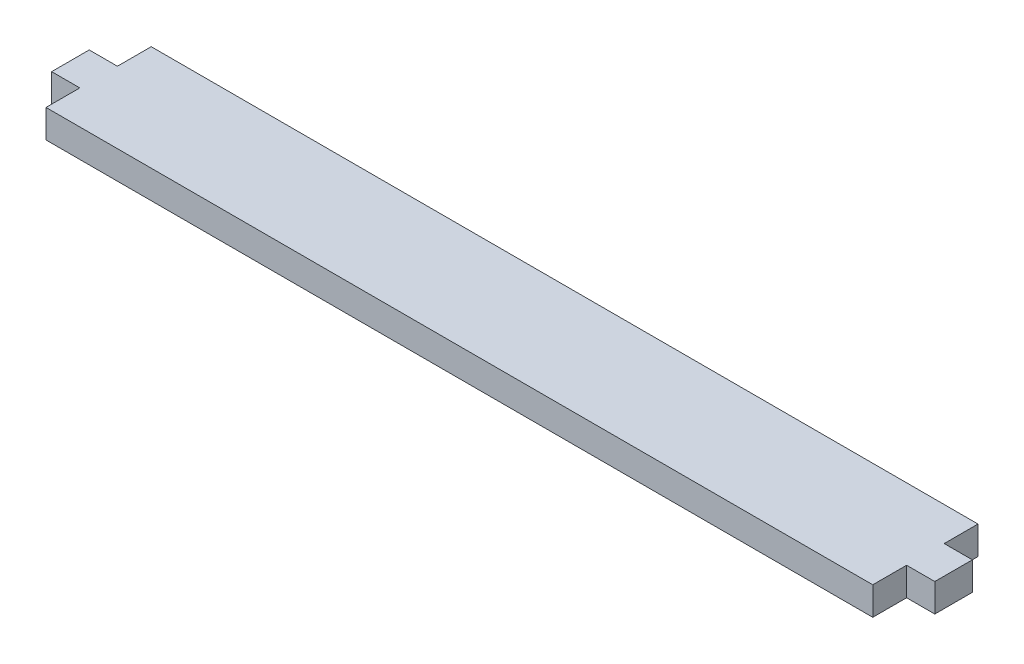
ISO-10303-21;
HEADER;
FILE_DESCRIPTION(('STEP AP214'),'2;1');
FILE_NAME('part.step','',(''),(''),'','','');
FILE_SCHEMA(('AUTOMOTIVE_DESIGN { 1 0 10303 214 1 1 1 1 }'));
ENDSEC;
DATA;
#1=APPLICATION_CONTEXT('core data for automotive mechanical design processes');
#2=APPLICATION_PROTOCOL_DEFINITION('international standard','automotive_design',2000,#1);
#3=PRODUCT_CONTEXT('',#1,'mechanical');
#4=PRODUCT('Part','Part','',(#3));
#5=PRODUCT_RELATED_PRODUCT_CATEGORY('part','',(#4));
#6=PRODUCT_DEFINITION_FORMATION('','',#4);
#7=PRODUCT_DEFINITION_CONTEXT('part definition',#1,'design');
#8=PRODUCT_DEFINITION('design','',#6,#7);
#9=PRODUCT_DEFINITION_SHAPE('','',#8);
#10=(LENGTH_UNIT() NAMED_UNIT(*) SI_UNIT(.MILLI.,.METRE.));
#11=(NAMED_UNIT(*) PLANE_ANGLE_UNIT() SI_UNIT($,.RADIAN.));
#12=(NAMED_UNIT(*) SI_UNIT($,.STERADIAN.) SOLID_ANGLE_UNIT());
#13=UNCERTAINTY_MEASURE_WITH_UNIT(LENGTH_MEASURE(1.E-05),#10,'distance_accuracy_value','');
#14=(GEOMETRIC_REPRESENTATION_CONTEXT(3) GLOBAL_UNCERTAINTY_ASSIGNED_CONTEXT((#13)) GLOBAL_UNIT_ASSIGNED_CONTEXT((#10,
#11,#12)) REPRESENTATION_CONTEXT('',''));
#15=CARTESIAN_POINT('',(0.,0.,0.));
#16=DIRECTION('',(0.,0.,1.));
#17=DIRECTION('',(1.,0.,0.));
#18=AXIS2_PLACEMENT_3D('',#15,#16,#17);
#19=CARTESIAN_POINT('',(-139.7,9.525,17.78));
#20=DIRECTION('',(1.,0.,0.));
#21=DIRECTION('',(0.,0.,-1.));
#22=AXIS2_PLACEMENT_3D('',#19,#20,#21);
#23=PLANE('',#22);
#24=DIRECTION('',(0.,0.,1.));
#25=VECTOR('',#24,1.);
#26=CARTESIAN_POINT('',(-139.7,9.525,17.78));
#27=LINE('',#26,#25);
#28=CARTESIAN_POINT('',(-139.7,9.525,6.34999999999998));
#29=VERTEX_POINT('',#28);
#30=CARTESIAN_POINT('',(-139.7,9.525,17.78));
#31=VERTEX_POINT('',#30);
#32=EDGE_CURVE('E219',#29,#31,#27,.T.);
#33=ORIENTED_EDGE('',*,*,#32,.F.);
#34=DIRECTION('',(0.,-1.,0.));
#35=VECTOR('',#34,1.);
#36=CARTESIAN_POINT('',(-139.7,0.,6.34999999999998));
#37=LINE('',#36,#35);
#38=CARTESIAN_POINT('',(-139.7,0.,6.34999999999998));
#39=VERTEX_POINT('',#38);
#40=EDGE_CURVE('E141',#29,#39,#37,.T.);
#41=ORIENTED_EDGE('',*,*,#40,.T.);
#42=DIRECTION('',(0.,0.,1.));
#43=VECTOR('',#42,1.);
#44=CARTESIAN_POINT('',(-139.7,0.,17.78));
#45=LINE('',#44,#43);
#46=CARTESIAN_POINT('',(-139.7,0.,17.78));
#47=VERTEX_POINT('',#46);
#48=EDGE_CURVE('E214',#39,#47,#45,.T.);
#49=ORIENTED_EDGE('',*,*,#48,.T.);
#50=DIRECTION('',(0.,-1.,0.));
#51=VECTOR('',#50,1.);
#52=CARTESIAN_POINT('',(-139.7,9.525,17.78));
#53=LINE('',#52,#51);
#54=EDGE_CURVE('E11',#31,#47,#53,.T.);
#55=ORIENTED_EDGE('',*,*,#54,.F.);
#56=EDGE_LOOP('',(#33,#41,#49,#55));
#57=FACE_BOUND('',#56,.T.);
#58=ADVANCED_FACE('F43',(#57),#23,.F.);
#59=CARTESIAN_POINT('',(139.7,9.525,17.78));
#60=DIRECTION('',(-1.,0.,0.));
#61=DIRECTION('',(0.,0.,1.));
#62=AXIS2_PLACEMENT_3D('',#59,#60,#61);
#63=PLANE('',#62);
#64=DIRECTION('',(0.,-1.,0.));
#65=VECTOR('',#64,1.);
#66=CARTESIAN_POINT('',(139.7,0.,6.34999999999998));
#67=LINE('',#66,#65);
#68=CARTESIAN_POINT('',(139.7,9.525,6.34999999999998));
#69=VERTEX_POINT('',#68);
#70=CARTESIAN_POINT('',(139.7,0.,6.34999999999998));
#71=VERTEX_POINT('',#70);
#72=EDGE_CURVE('E67',#69,#71,#67,.T.);
#73=ORIENTED_EDGE('',*,*,#72,.F.);
#74=DIRECTION('',(0.,0.,-1.));
#75=VECTOR('',#74,1.);
#76=CARTESIAN_POINT('',(139.7,9.525,17.78));
#77=LINE('',#76,#75);
#78=CARTESIAN_POINT('',(139.7,9.525,17.78));
#79=VERTEX_POINT('',#78);
#80=EDGE_CURVE('E223',#79,#69,#77,.T.);
#81=ORIENTED_EDGE('',*,*,#80,.F.);
#82=DIRECTION('',(0.,-1.,0.));
#83=VECTOR('',#82,1.);
#84=CARTESIAN_POINT('',(139.7,9.525,17.78));
#85=LINE('',#84,#83);
#86=CARTESIAN_POINT('',(139.7,0.,17.78));
#87=VERTEX_POINT('',#86);
#88=EDGE_CURVE('E52',#79,#87,#85,.T.);
#89=ORIENTED_EDGE('',*,*,#88,.T.);
#90=DIRECTION('',(0.,0.,-1.));
#91=VECTOR('',#90,1.);
#92=CARTESIAN_POINT('',(139.7,0.,17.78));
#93=LINE('',#92,#91);
#94=EDGE_CURVE('E238',#87,#71,#93,.T.);
#95=ORIENTED_EDGE('',*,*,#94,.T.);
#96=EDGE_LOOP('',(#73,#81,#89,#95));
#97=FACE_BOUND('',#96,.T.);
#98=ADVANCED_FACE('F254',(#97),#63,.F.);
#99=DIRECTION('',(0.,1.,0.));
#100=VECTOR('',#99,1.);
#101=CARTESIAN_POINT('',(139.7,0.,-6.35000000000002));
#102=LINE('',#101,#100);
#103=CARTESIAN_POINT('',(139.7,0.,-6.35000000000002));
#104=VERTEX_POINT('',#103);
#105=CARTESIAN_POINT('',(139.7,9.525,-6.35000000000002));
#106=VERTEX_POINT('',#105);
#107=EDGE_CURVE('E184',#104,#106,#102,.T.);
#108=ORIENTED_EDGE('',*,*,#107,.F.);
#109=CARTESIAN_POINT('',(139.7,0.,-17.78));
#110=VERTEX_POINT('',#109);
#111=EDGE_CURVE('E237',#104,#110,#93,.T.);
#112=ORIENTED_EDGE('',*,*,#111,.T.);
#113=DIRECTION('',(0.,-1.,0.));
#114=VECTOR('',#113,1.);
#115=CARTESIAN_POINT('',(139.7,9.525,-17.78));
#116=LINE('',#115,#114);
#117=CARTESIAN_POINT('',(139.7,9.525,-17.78));
#118=VERTEX_POINT('',#117);
#119=EDGE_CURVE('E247',#118,#110,#116,.T.);
#120=ORIENTED_EDGE('',*,*,#119,.F.);
#121=EDGE_CURVE('E222',#106,#118,#77,.T.);
#122=ORIENTED_EDGE('',*,*,#121,.F.);
#123=EDGE_LOOP('',(#108,#112,#120,#122));
#124=FACE_BOUND('',#123,.T.);
#125=ADVANCED_FACE('F281',(#124),#63,.F.);
#126=CARTESIAN_POINT('',(-139.7,0.,-17.78));
#127=VERTEX_POINT('',#126);
#128=CARTESIAN_POINT('',(-139.7,0.,-6.35000000000002));
#129=VERTEX_POINT('',#128);
#130=EDGE_CURVE('E230',#127,#129,#45,.T.);
#131=ORIENTED_EDGE('',*,*,#130,.T.);
#132=DIRECTION('',(0.,1.,0.));
#133=VECTOR('',#132,1.);
#134=CARTESIAN_POINT('',(-139.7,0.,-6.35000000000002));
#135=LINE('',#134,#133);
#136=CARTESIAN_POINT('',(-139.7,9.525,-6.35000000000002));
#137=VERTEX_POINT('',#136);
#138=EDGE_CURVE('E155',#129,#137,#135,.T.);
#139=ORIENTED_EDGE('',*,*,#138,.T.);
#140=CARTESIAN_POINT('',(-139.7,9.525,-17.78));
#141=VERTEX_POINT('',#140);
#142=EDGE_CURVE('E215',#141,#137,#27,.T.);
#143=ORIENTED_EDGE('',*,*,#142,.F.);
#144=DIRECTION('',(0.,-1.,0.));
#145=VECTOR('',#144,1.);
#146=CARTESIAN_POINT('',(-139.7,9.525,-17.78));
#147=LINE('',#146,#145);
#148=EDGE_CURVE('E229',#141,#127,#147,.T.);
#149=ORIENTED_EDGE('',*,*,#148,.T.);
#150=EDGE_LOOP('',(#131,#139,#143,#149));
#151=FACE_BOUND('',#150,.T.);
#152=ADVANCED_FACE('F45',(#151),#23,.F.);
#153=CARTESIAN_POINT('',(139.7,9.525,17.78));
#154=DIRECTION('',(0.,0.,-1.));
#155=DIRECTION('',(-1.,0.,0.));
#156=AXIS2_PLACEMENT_3D('',#153,#154,#155);
#157=PLANE('',#156);
#158=DIRECTION('',(1.,0.,0.));
#159=VECTOR('',#158,1.);
#160=CARTESIAN_POINT('',(139.7,0.,17.78));
#161=LINE('',#160,#159);
#162=EDGE_CURVE('E234',#47,#87,#161,.T.);
#163=ORIENTED_EDGE('',*,*,#162,.T.);
#164=ORIENTED_EDGE('',*,*,#88,.F.);
#165=DIRECTION('',(1.,0.,0.));
#166=VECTOR('',#165,1.);
#167=CARTESIAN_POINT('',(139.7,9.525,17.78));
#168=LINE('',#167,#166);
#169=EDGE_CURVE('E218',#31,#79,#168,.T.);
#170=ORIENTED_EDGE('',*,*,#169,.F.);
#171=ORIENTED_EDGE('',*,*,#54,.T.);
#172=EDGE_LOOP('',(#163,#164,#170,#171));
#173=FACE_BOUND('',#172,.T.);
#174=ADVANCED_FACE('F270',(#173),#157,.F.);
#175=CARTESIAN_POINT('',(139.7,9.525,-17.78));
#176=DIRECTION('',(0.,0.,1.));
#177=DIRECTION('',(1.,0.,0.));
#178=AXIS2_PLACEMENT_3D('',#175,#176,#177);
#179=PLANE('',#178);
#180=DIRECTION('',(-1.,0.,0.));
#181=VECTOR('',#180,1.);
#182=CARTESIAN_POINT('',(139.7,0.,-17.78));
#183=LINE('',#182,#181);
#184=EDGE_CURVE('E241',#110,#127,#183,.T.);
#185=ORIENTED_EDGE('',*,*,#184,.T.);
#186=ORIENTED_EDGE('',*,*,#148,.F.);
#187=DIRECTION('',(-1.,0.,0.));
#188=VECTOR('',#187,1.);
#189=CARTESIAN_POINT('',(139.7,9.525,-17.78));
#190=LINE('',#189,#188);
#191=EDGE_CURVE('E226',#118,#141,#190,.T.);
#192=ORIENTED_EDGE('',*,*,#191,.F.);
#193=ORIENTED_EDGE('',*,*,#119,.T.);
#194=EDGE_LOOP('',(#185,#186,#192,#193));
#195=FACE_BOUND('',#194,.T.);
#196=ADVANCED_FACE('F285',(#195),#179,.F.);
#197=CARTESIAN_POINT('',(0.,9.525,0.));
#198=DIRECTION('',(0.,1.,0.));
#199=DIRECTION('',(0.,0.,1.));
#200=AXIS2_PLACEMENT_3D('',#197,#198,#199);
#201=PLANE('',#200);
#202=ORIENTED_EDGE('',*,*,#142,.T.);
#203=DIRECTION('',(1.,0.,0.));
#204=VECTOR('',#203,1.);
#205=CARTESIAN_POINT('',(-149.225,9.525,-6.35000000000002));
#206=LINE('',#205,#204);
#207=CARTESIAN_POINT('',(-149.225,9.525,-6.35000000000002));
#208=VERTEX_POINT('',#207);
#209=EDGE_CURVE('E59',#208,#137,#206,.T.);
#210=ORIENTED_EDGE('',*,*,#209,.F.);
#211=DIRECTION('',(0.,0.,1.));
#212=VECTOR('',#211,1.);
#213=CARTESIAN_POINT('',(-149.225,9.525,6.34999999999998));
#214=LINE('',#213,#212);
#215=CARTESIAN_POINT('',(-149.225,9.525,6.34999999999998));
#216=VERTEX_POINT('',#215);
#217=EDGE_CURVE('E151',#208,#216,#214,.T.);
#218=ORIENTED_EDGE('',*,*,#217,.T.);
#219=DIRECTION('',(1.,0.,0.));
#220=VECTOR('',#219,1.);
#221=CARTESIAN_POINT('',(-149.225,9.525,6.34999999999998));
#222=LINE('',#221,#220);
#223=EDGE_CURVE('E135',#216,#29,#222,.T.);
#224=ORIENTED_EDGE('',*,*,#223,.T.);
#225=ORIENTED_EDGE('',*,*,#32,.T.);
#226=ORIENTED_EDGE('',*,*,#169,.T.);
#227=ORIENTED_EDGE('',*,*,#80,.T.);
#228=DIRECTION('',(-1.,0.,0.));
#229=VECTOR('',#228,1.);
#230=CARTESIAN_POINT('',(149.225,9.525,6.34999999999998));
#231=LINE('',#230,#229);
#232=CARTESIAN_POINT('',(149.225,9.525,6.34999999999998));
#233=VERTEX_POINT('',#232);
#234=EDGE_CURVE('E193',#233,#69,#231,.T.);
#235=ORIENTED_EDGE('',*,*,#234,.F.);
#236=DIRECTION('',(0.,0.,1.));
#237=VECTOR('',#236,1.);
#238=CARTESIAN_POINT('',(149.225,9.525,6.34999999999998));
#239=LINE('',#238,#237);
#240=CARTESIAN_POINT('',(149.225,9.525,-6.35000000000002));
#241=VERTEX_POINT('',#240);
#242=EDGE_CURVE('E190',#241,#233,#239,.T.);
#243=ORIENTED_EDGE('',*,*,#242,.F.);
#244=DIRECTION('',(-1.,0.,0.));
#245=VECTOR('',#244,1.);
#246=CARTESIAN_POINT('',(149.225,9.525,-6.35000000000002));
#247=LINE('',#246,#245);
#248=EDGE_CURVE('E202',#241,#106,#247,.T.);
#249=ORIENTED_EDGE('',*,*,#248,.T.);
#250=ORIENTED_EDGE('',*,*,#121,.T.);
#251=ORIENTED_EDGE('',*,*,#191,.T.);
#252=EDGE_LOOP('',(#202,#210,#218,#224,#225,#226,#227,#235,#243,#249,#250,#251));
#253=FACE_BOUND('',#252,.T.);
#254=ADVANCED_FACE('F158',(#253),#201,.T.);
#255=CARTESIAN_POINT('',(0.,0.,0.));
#256=DIRECTION('',(0.,1.,0.));
#257=DIRECTION('',(0.,0.,1.));
#258=AXIS2_PLACEMENT_3D('',#255,#256,#257);
#259=PLANE('',#258);
#260=ORIENTED_EDGE('',*,*,#130,.F.);
#261=ORIENTED_EDGE('',*,*,#184,.F.);
#262=ORIENTED_EDGE('',*,*,#111,.F.);
#263=DIRECTION('',(-1.,0.,0.));
#264=VECTOR('',#263,1.);
#265=CARTESIAN_POINT('',(149.225,0.,-6.35000000000002));
#266=LINE('',#265,#264);
#267=CARTESIAN_POINT('',(149.225,0.,-6.35000000000002));
#268=VERTEX_POINT('',#267);
#269=EDGE_CURVE('E206',#268,#104,#266,.T.);
#270=ORIENTED_EDGE('',*,*,#269,.F.);
#271=DIRECTION('',(0.,0.,-1.));
#272=VECTOR('',#271,1.);
#273=CARTESIAN_POINT('',(149.225,0.,6.34999999999998));
#274=LINE('',#273,#272);
#275=CARTESIAN_POINT('',(149.225,0.,6.34999999999998));
#276=VERTEX_POINT('',#275);
#277=EDGE_CURVE('E183',#276,#268,#274,.T.);
#278=ORIENTED_EDGE('',*,*,#277,.F.);
#279=DIRECTION('',(-1.,0.,0.));
#280=VECTOR('',#279,1.);
#281=CARTESIAN_POINT('',(149.225,0.,6.34999999999998));
#282=LINE('',#281,#280);
#283=EDGE_CURVE('E210',#276,#71,#282,.T.);
#284=ORIENTED_EDGE('',*,*,#283,.T.);
#285=ORIENTED_EDGE('',*,*,#94,.F.);
#286=ORIENTED_EDGE('',*,*,#162,.F.);
#287=ORIENTED_EDGE('',*,*,#48,.F.);
#288=DIRECTION('',(1.,0.,0.));
#289=VECTOR('',#288,1.);
#290=CARTESIAN_POINT('',(-149.225,0.,6.34999999999998));
#291=LINE('',#290,#289);
#292=CARTESIAN_POINT('',(-149.225,0.,6.34999999999998));
#293=VERTEX_POINT('',#292);
#294=EDGE_CURVE('E167',#293,#39,#291,.T.);
#295=ORIENTED_EDGE('',*,*,#294,.F.);
#296=DIRECTION('',(0.,0.,-1.));
#297=VECTOR('',#296,1.);
#298=CARTESIAN_POINT('',(-149.225,0.,6.34999999999998));
#299=LINE('',#298,#297);
#300=CARTESIAN_POINT('',(-149.225,0.,-6.35000000000002));
#301=VERTEX_POINT('',#300);
#302=EDGE_CURVE('E153',#293,#301,#299,.T.);
#303=ORIENTED_EDGE('',*,*,#302,.T.);
#304=DIRECTION('',(1.,0.,0.));
#305=VECTOR('',#304,1.);
#306=CARTESIAN_POINT('',(-149.225,0.,-6.35000000000002));
#307=LINE('',#306,#305);
#308=EDGE_CURVE('E174',#301,#129,#307,.T.);
#309=ORIENTED_EDGE('',*,*,#308,.T.);
#310=EDGE_LOOP('',(#260,#261,#262,#270,#278,#284,#285,#286,#287,#295,#303,#309));
#311=FACE_BOUND('',#310,.T.);
#312=ADVANCED_FACE('F260',(#311),#259,.F.);
#313=CARTESIAN_POINT('',(149.225,0.,6.34999999999998));
#314=DIRECTION('',(0.,0.,-1.));
#315=DIRECTION('',(-1.,0.,0.));
#316=AXIS2_PLACEMENT_3D('',#313,#314,#315);
#317=PLANE('',#316);
#318=ORIENTED_EDGE('',*,*,#72,.T.);
#319=ORIENTED_EDGE('',*,*,#283,.F.);
#320=DIRECTION('',(0.,-1.,0.));
#321=VECTOR('',#320,1.);
#322=CARTESIAN_POINT('',(149.225,0.,6.34999999999998));
#323=LINE('',#322,#321);
#324=EDGE_CURVE('E179',#233,#276,#323,.T.);
#325=ORIENTED_EDGE('',*,*,#324,.F.);
#326=ORIENTED_EDGE('',*,*,#234,.T.);
#327=EDGE_LOOP('',(#318,#319,#325,#326));
#328=FACE_BOUND('',#327,.T.);
#329=ADVANCED_FACE('F266',(#328),#317,.F.);
#330=CARTESIAN_POINT('',(149.225,0.,-6.35000000000002));
#331=DIRECTION('',(0.,0.,1.));
#332=DIRECTION('',(1.,0.,0.));
#333=AXIS2_PLACEMENT_3D('',#330,#331,#332);
#334=PLANE('',#333);
#335=ORIENTED_EDGE('',*,*,#107,.T.);
#336=ORIENTED_EDGE('',*,*,#248,.F.);
#337=DIRECTION('',(0.,1.,0.));
#338=VECTOR('',#337,1.);
#339=CARTESIAN_POINT('',(149.225,0.,-6.35000000000002));
#340=LINE('',#339,#338);
#341=EDGE_CURVE('E187',#268,#241,#340,.T.);
#342=ORIENTED_EDGE('',*,*,#341,.F.);
#343=ORIENTED_EDGE('',*,*,#269,.T.);
#344=EDGE_LOOP('',(#335,#336,#342,#343));
#345=FACE_BOUND('',#344,.T.);
#346=ADVANCED_FACE('F291',(#345),#334,.F.);
#347=CARTESIAN_POINT('',(149.225,0.,0.));
#348=DIRECTION('',(-1.,0.,0.));
#349=DIRECTION('',(0.,0.,1.));
#350=AXIS2_PLACEMENT_3D('',#347,#348,#349);
#351=PLANE('',#350);
#352=ORIENTED_EDGE('',*,*,#324,.T.);
#353=ORIENTED_EDGE('',*,*,#277,.T.);
#354=ORIENTED_EDGE('',*,*,#341,.T.);
#355=ORIENTED_EDGE('',*,*,#242,.T.);
#356=EDGE_LOOP('',(#352,#353,#354,#355));
#357=FACE_BOUND('',#356,.T.);
#358=ADVANCED_FACE('F293',(#357),#351,.F.);
#359=CARTESIAN_POINT('',(-149.225,0.,6.34999999999998));
#360=DIRECTION('',(0.,0.,1.));
#361=DIRECTION('',(1.,0.,0.));
#362=AXIS2_PLACEMENT_3D('',#359,#360,#361);
#363=PLANE('',#362);
#364=ORIENTED_EDGE('',*,*,#40,.F.);
#365=ORIENTED_EDGE('',*,*,#223,.F.);
#366=DIRECTION('',(0.,-1.,0.));
#367=VECTOR('',#366,1.);
#368=CARTESIAN_POINT('',(-149.225,0.,6.34999999999998));
#369=LINE('',#368,#367);
#370=EDGE_CURVE('E138',#216,#293,#369,.T.);
#371=ORIENTED_EDGE('',*,*,#370,.T.);
#372=ORIENTED_EDGE('',*,*,#294,.T.);
#373=EDGE_LOOP('',(#364,#365,#371,#372));
#374=FACE_BOUND('',#373,.T.);
#375=ADVANCED_FACE('F137',(#374),#363,.T.);
#376=CARTESIAN_POINT('',(-149.225,0.,-6.35000000000002));
#377=DIRECTION('',(0.,0.,-1.));
#378=DIRECTION('',(-1.,0.,0.));
#379=AXIS2_PLACEMENT_3D('',#376,#377,#378);
#380=PLANE('',#379);
#381=ORIENTED_EDGE('',*,*,#138,.F.);
#382=ORIENTED_EDGE('',*,*,#308,.F.);
#383=DIRECTION('',(0.,1.,0.));
#384=VECTOR('',#383,1.);
#385=CARTESIAN_POINT('',(-149.225,0.,-6.35000000000002));
#386=LINE('',#385,#384);
#387=EDGE_CURVE('E160',#301,#208,#386,.T.);
#388=ORIENTED_EDGE('',*,*,#387,.T.);
#389=ORIENTED_EDGE('',*,*,#209,.T.);
#390=EDGE_LOOP('',(#381,#382,#388,#389));
#391=FACE_BOUND('',#390,.T.);
#392=ADVANCED_FACE('F288',(#391),#380,.T.);
#393=CARTESIAN_POINT('',(-149.225,0.,0.));
#394=DIRECTION('',(1.,0.,0.));
#395=DIRECTION('',(0.,0.,1.));
#396=AXIS2_PLACEMENT_3D('',#393,#394,#395);
#397=PLANE('',#396);
#398=ORIENTED_EDGE('',*,*,#370,.F.);
#399=ORIENTED_EDGE('',*,*,#217,.F.);
#400=ORIENTED_EDGE('',*,*,#387,.F.);
#401=ORIENTED_EDGE('',*,*,#302,.F.);
#402=EDGE_LOOP('',(#398,#399,#400,#401));
#403=FACE_BOUND('',#402,.T.);
#404=ADVANCED_FACE('F149',(#403),#397,.F.);
#405=CLOSED_SHELL('',(#58,#98,#125,#152,#174,#196,#254,#312,#329,#346,#358,#375,#392,#404));
#406=MANIFOLD_SOLID_BREP('B2',#405);
#407=ADVANCED_BREP_SHAPE_REPRESENTATION('',(#18,#406),#14);
#408=SHAPE_DEFINITION_REPRESENTATION(#9,#407);
ENDSEC;
END-ISO-10303-21;
